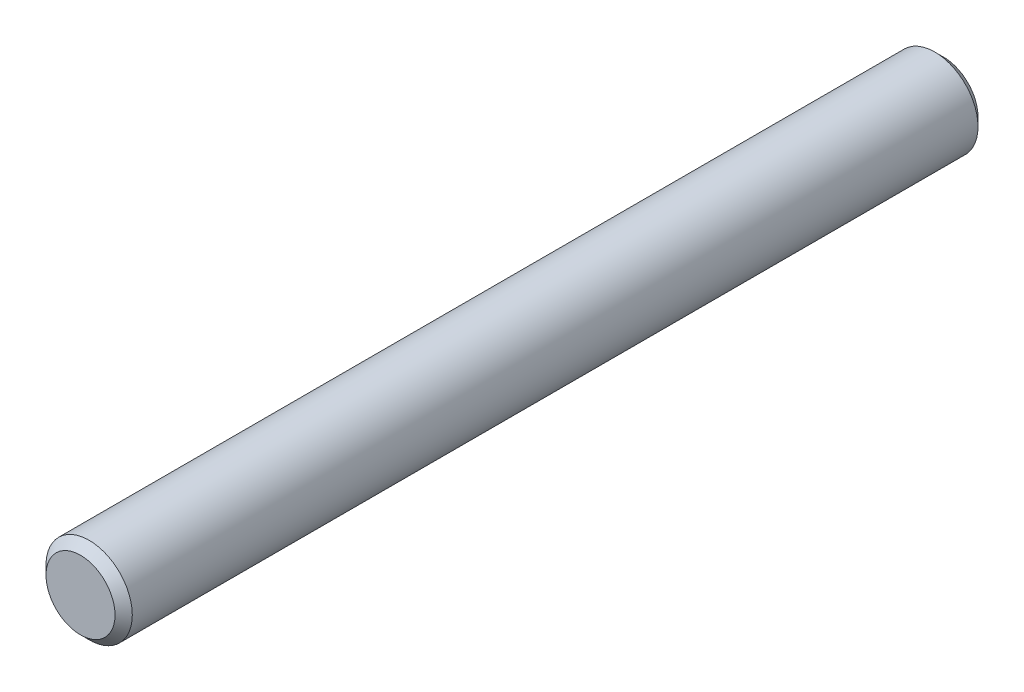
ISO-10303-21;
HEADER;
FILE_DESCRIPTION(('STEP AP214'),'2;1');
FILE_NAME('part.step','',(''),(''),'','','');
FILE_SCHEMA(('AUTOMOTIVE_DESIGN { 1 0 10303 214 1 1 1 1 }'));
ENDSEC;
DATA;
#1=APPLICATION_CONTEXT('core data for automotive mechanical design processes');
#2=APPLICATION_PROTOCOL_DEFINITION('international standard','automotive_design',2000,#1);
#3=PRODUCT_CONTEXT('',#1,'mechanical');
#4=PRODUCT('Part','Part','',(#3));
#5=PRODUCT_RELATED_PRODUCT_CATEGORY('part','',(#4));
#6=PRODUCT_DEFINITION_FORMATION('','',#4);
#7=PRODUCT_DEFINITION_CONTEXT('part definition',#1,'design');
#8=PRODUCT_DEFINITION('design','',#6,#7);
#9=PRODUCT_DEFINITION_SHAPE('','',#8);
#10=(LENGTH_UNIT() NAMED_UNIT(*) SI_UNIT(.MILLI.,.METRE.));
#11=(NAMED_UNIT(*) PLANE_ANGLE_UNIT() SI_UNIT($,.RADIAN.));
#12=(NAMED_UNIT(*) SI_UNIT($,.STERADIAN.) SOLID_ANGLE_UNIT());
#13=UNCERTAINTY_MEASURE_WITH_UNIT(LENGTH_MEASURE(1.E-05),#10,'distance_accuracy_value','');
#14=(GEOMETRIC_REPRESENTATION_CONTEXT(3) GLOBAL_UNCERTAINTY_ASSIGNED_CONTEXT((#13)) GLOBAL_UNIT_ASSIGNED_CONTEXT((#10,
#11,#12)) REPRESENTATION_CONTEXT('',''));
#15=CARTESIAN_POINT('',(0.,0.,0.));
#16=DIRECTION('',(0.,0.,1.));
#17=DIRECTION('',(1.,0.,0.));
#18=AXIS2_PLACEMENT_3D('',#15,#16,#17);
#19=CARTESIAN_POINT('',(0.,0.,100.));
#20=DIRECTION('',(0.,0.,-1.));
#21=DIRECTION('',(-1.,0.,0.));
#22=AXIS2_PLACEMENT_3D('',#19,#20,#21);
#23=CYLINDRICAL_SURFACE('',#22,5.);
#24=CARTESIAN_POINT('',(0.,0.,1.00000000000001));
#25=DIRECTION('',(0.,0.,1.));
#26=DIRECTION('',(1.,0.,0.));
#27=AXIS2_PLACEMENT_3D('',#24,#25,#26);
#28=CIRCLE('',#27,5.);
#29=CARTESIAN_POINT('',(5.,0.,1.00000000000001));
#30=VERTEX_POINT('',#29);
#31=EDGE_CURVE('E43',#30,#30,#28,.T.);
#32=ORIENTED_EDGE('',*,*,#31,.T.);
#33=EDGE_LOOP('',(#32));
#34=FACE_BOUND('',#33,.T.);
#35=CARTESIAN_POINT('',(0.,0.,99.));
#36=DIRECTION('',(0.,0.,1.));
#37=DIRECTION('',(1.,0.,0.));
#38=AXIS2_PLACEMENT_3D('',#35,#36,#37);
#39=CIRCLE('',#38,5.);
#40=CARTESIAN_POINT('',(5.,0.,99.));
#41=VERTEX_POINT('',#40);
#42=EDGE_CURVE('E47',#41,#41,#39,.F.);
#43=ORIENTED_EDGE('',*,*,#42,.T.);
#44=EDGE_LOOP('',(#43));
#45=FACE_BOUND('',#44,.T.);
#46=ADVANCED_FACE('F32',(#34,#45),#23,.T.);
#47=CARTESIAN_POINT('',(0.,0.,100.));
#48=DIRECTION('',(0.,0.,1.));
#49=DIRECTION('',(1.,0.,0.));
#50=AXIS2_PLACEMENT_3D('',#47,#48,#49);
#51=PLANE('',#50);
#52=CARTESIAN_POINT('',(0.,0.,100.));
#53=DIRECTION('',(0.,0.,1.));
#54=DIRECTION('',(1.,0.,0.));
#55=AXIS2_PLACEMENT_3D('',#52,#53,#54);
#56=CIRCLE('',#55,4.);
#57=CARTESIAN_POINT('',(4.,0.,100.));
#58=VERTEX_POINT('',#57);
#59=EDGE_CURVE('E10',#58,#58,#56,.T.);
#60=ORIENTED_EDGE('',*,*,#59,.T.);
#61=EDGE_LOOP('',(#60));
#62=FACE_BOUND('',#61,.T.);
#63=ADVANCED_FACE('F63',(#62),#51,.T.);
#64=CARTESIAN_POINT('',(0.,0.,0.));
#65=DIRECTION('',(0.,0.,1.));
#66=DIRECTION('',(1.,0.,0.));
#67=AXIS2_PLACEMENT_3D('',#64,#65,#66);
#68=PLANE('',#67);
#69=CARTESIAN_POINT('',(0.,0.,0.));
#70=DIRECTION('',(0.,0.,1.));
#71=DIRECTION('',(1.,0.,0.));
#72=AXIS2_PLACEMENT_3D('',#69,#70,#71);
#73=CIRCLE('',#72,3.99999999999998);
#74=CARTESIAN_POINT('',(3.99999999999998,0.,0.));
#75=VERTEX_POINT('',#74);
#76=EDGE_CURVE('E39',#75,#75,#73,.F.);
#77=ORIENTED_EDGE('',*,*,#76,.T.);
#78=EDGE_LOOP('',(#77));
#79=FACE_BOUND('',#78,.T.);
#80=ADVANCED_FACE('F60',(#79),#68,.F.);
#81=CARTESIAN_POINT('',(0.,0.,1.00000000000001));
#82=DIRECTION('',(0.,0.,1.));
#83=DIRECTION('',(1.,0.,0.));
#84=AXIS2_PLACEMENT_3D('',#81,#82,#83);
#85=CONICAL_SURFACE('',#84,5.,0.785398163397453);
#86=ORIENTED_EDGE('',*,*,#76,.F.);
#87=EDGE_LOOP('',(#86));
#88=FACE_BOUND('',#87,.T.);
#89=ORIENTED_EDGE('',*,*,#31,.F.);
#90=EDGE_LOOP('',(#89));
#91=FACE_BOUND('',#90,.T.);
#92=ADVANCED_FACE('F56',(#88,#91),#85,.T.);
#93=CARTESIAN_POINT('',(0.,0.,100.));
#94=DIRECTION('',(0.,0.,-1.));
#95=DIRECTION('',(-1.,0.,0.));
#96=AXIS2_PLACEMENT_3D('',#93,#94,#95);
#97=CONICAL_SURFACE('',#96,4.,0.785398163397446);
#98=ORIENTED_EDGE('',*,*,#42,.F.);
#99=EDGE_LOOP('',(#98));
#100=FACE_BOUND('',#99,.T.);
#101=ORIENTED_EDGE('',*,*,#59,.F.);
#102=EDGE_LOOP('',(#101));
#103=FACE_BOUND('',#102,.T.);
#104=ADVANCED_FACE('F34',(#100,#103),#97,.T.);
#105=CLOSED_SHELL('',(#46,#63,#80,#92,#104));
#106=MANIFOLD_SOLID_BREP('B2',#105);
#107=ADVANCED_BREP_SHAPE_REPRESENTATION('',(#18,#106),#14);
#108=SHAPE_DEFINITION_REPRESENTATION(#9,#107);
ENDSEC;
END-ISO-10303-21;
